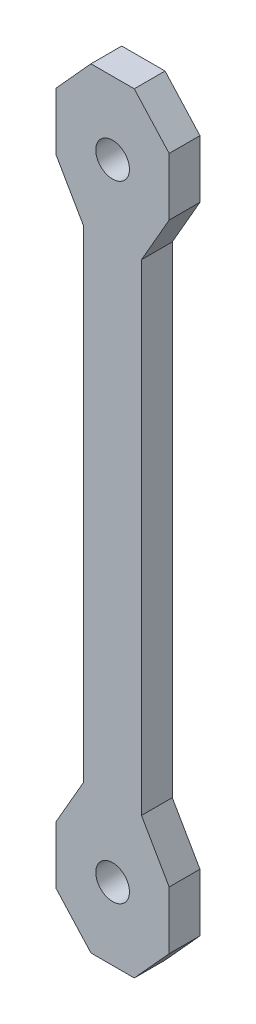
ISO-10303-21;
HEADER;
FILE_DESCRIPTION(('STEP AP214'),'2;1');
FILE_NAME('part.step','',(''),(''),'','','');
FILE_SCHEMA(('AUTOMOTIVE_DESIGN { 1 0 10303 214 1 1 1 1 }'));
ENDSEC;
DATA;
#1=APPLICATION_CONTEXT('core data for automotive mechanical design processes');
#2=APPLICATION_PROTOCOL_DEFINITION('international standard','automotive_design',2000,#1);
#3=PRODUCT_CONTEXT('',#1,'mechanical');
#4=PRODUCT('Part','Part','',(#3));
#5=PRODUCT_RELATED_PRODUCT_CATEGORY('part','',(#4));
#6=PRODUCT_DEFINITION_FORMATION('','',#4);
#7=PRODUCT_DEFINITION_CONTEXT('part definition',#1,'design');
#8=PRODUCT_DEFINITION('design','',#6,#7);
#9=PRODUCT_DEFINITION_SHAPE('','',#8);
#10=(LENGTH_UNIT() NAMED_UNIT(*) SI_UNIT(.MILLI.,.METRE.));
#11=(NAMED_UNIT(*) PLANE_ANGLE_UNIT() SI_UNIT($,.RADIAN.));
#12=(NAMED_UNIT(*) SI_UNIT($,.STERADIAN.) SOLID_ANGLE_UNIT());
#13=UNCERTAINTY_MEASURE_WITH_UNIT(LENGTH_MEASURE(1.E-05),#10,'distance_accuracy_value','');
#14=(GEOMETRIC_REPRESENTATION_CONTEXT(3) GLOBAL_UNCERTAINTY_ASSIGNED_CONTEXT((#13)) GLOBAL_UNIT_ASSIGNED_CONTEXT((#10,
#11,#12)) REPRESENTATION_CONTEXT('',''));
#15=CARTESIAN_POINT('',(0.,0.,0.));
#16=DIRECTION('',(0.,0.,1.));
#17=DIRECTION('',(1.,0.,0.));
#18=AXIS2_PLACEMENT_3D('',#15,#16,#17);
#19=CARTESIAN_POINT('',(0.,0.,6.4));
#20=DIRECTION('',(0.,0.,-1.));
#21=DIRECTION('',(-1.,0.,0.));
#22=AXIS2_PLACEMENT_3D('',#19,#20,#21);
#23=PLANE('',#22);
#24=DIRECTION('',(0.,-1.,0.));
#25=VECTOR('',#24,1.);
#26=CARTESIAN_POINT('',(-6.,15.1491889334921,6.4));
#27=LINE('',#26,#25);
#28=CARTESIAN_POINT('',(-6.,65.1491889334921,6.4));
#29=VERTEX_POINT('',#28);
#30=CARTESIAN_POINT('',(-6.,-34.8508110665079,6.4));
#31=VERTEX_POINT('',#30);
#32=EDGE_CURVE('E118',#29,#31,#27,.T.);
#33=ORIENTED_EDGE('',*,*,#32,.T.);
#34=DIRECTION('',(-0.498471124258083,-0.866906303057535,0.));
#35=VECTOR('',#34,1.);
#36=CARTESIAN_POINT('',(-6.,-34.8508110665079,6.4));
#37=LINE('',#36,#35);
#38=CARTESIAN_POINT('',(-11.75,-44.8508110665079,6.4));
#39=VERTEX_POINT('',#38);
#40=EDGE_CURVE('E300',#31,#39,#37,.T.);
#41=ORIENTED_EDGE('',*,*,#40,.T.);
#42=DIRECTION('',(0.,-1.,0.));
#43=VECTOR('',#42,1.);
#44=CARTESIAN_POINT('',(-11.75,-44.8508110665079,6.4));
#45=LINE('',#44,#43);
#46=CARTESIAN_POINT('',(-11.75,-56.8508110665079,6.4));
#47=VERTEX_POINT('',#46);
#48=EDGE_CURVE('E251',#39,#47,#45,.T.);
#49=ORIENTED_EDGE('',*,*,#48,.T.);
#50=DIRECTION('',(0.67151942473886,-0.740986951435983,0.));
#51=VECTOR('',#50,1.);
#52=CARTESIAN_POINT('',(-11.75,-56.8508110665079,6.4));
#53=LINE('',#52,#51);
#54=CARTESIAN_POINT('',(-4.49999999999998,-64.8508110665079,6.4));
#55=VERTEX_POINT('',#54);
#56=EDGE_CURVE('E270',#47,#55,#53,.T.);
#57=ORIENTED_EDGE('',*,*,#56,.T.);
#58=DIRECTION('',(1.,0.,0.));
#59=VECTOR('',#58,1.);
#60=CARTESIAN_POINT('',(-4.49999999999998,-64.8508110665079,6.4));
#61=LINE('',#60,#59);
#62=CARTESIAN_POINT('',(4.50000000000001,-64.8508110665079,6.4));
#63=VERTEX_POINT('',#62);
#64=EDGE_CURVE('E267',#55,#63,#61,.T.);
#65=ORIENTED_EDGE('',*,*,#64,.T.);
#66=DIRECTION('',(0.671519424738859,0.740986951435983,0.));
#67=VECTOR('',#66,1.);
#68=CARTESIAN_POINT('',(4.50000000000001,-64.8508110665079,6.4));
#69=LINE('',#68,#67);
#70=CARTESIAN_POINT('',(11.75,-56.8508110665079,6.4));
#71=VERTEX_POINT('',#70);
#72=EDGE_CURVE('E269',#63,#71,#69,.T.);
#73=ORIENTED_EDGE('',*,*,#72,.T.);
#74=DIRECTION('',(0.,1.,0.));
#75=VECTOR('',#74,1.);
#76=CARTESIAN_POINT('',(11.75,-56.8508110665079,6.4));
#77=LINE('',#76,#75);
#78=CARTESIAN_POINT('',(11.75,-44.8508110665079,6.4));
#79=VERTEX_POINT('',#78);
#80=EDGE_CURVE('E272',#71,#79,#77,.T.);
#81=ORIENTED_EDGE('',*,*,#80,.T.);
#82=DIRECTION('',(-0.498471124258083,0.866906303057535,0.));
#83=VECTOR('',#82,1.);
#84=CARTESIAN_POINT('',(11.75,-44.8508110665079,6.4));
#85=LINE('',#84,#83);
#86=CARTESIAN_POINT('',(6.,-34.8508110665079,6.4));
#87=VERTEX_POINT('',#86);
#88=EDGE_CURVE('E278',#79,#87,#85,.T.);
#89=ORIENTED_EDGE('',*,*,#88,.T.);
#90=DIRECTION('',(0.,1.,0.));
#91=VECTOR('',#90,1.);
#92=CARTESIAN_POINT('',(6.,15.1491889334921,6.4));
#93=LINE('',#92,#91);
#94=CARTESIAN_POINT('',(6.,65.1491889334921,6.4));
#95=VERTEX_POINT('',#94);
#96=EDGE_CURVE('E280',#87,#95,#93,.T.);
#97=ORIENTED_EDGE('',*,*,#96,.T.);
#98=DIRECTION('',(0.498471124258083,0.866906303057535,0.));
#99=VECTOR('',#98,1.);
#100=CARTESIAN_POINT('',(11.75,75.1491889334921,6.4));
#101=LINE('',#100,#99);
#102=CARTESIAN_POINT('',(11.75,75.1491889334921,6.4));
#103=VERTEX_POINT('',#102);
#104=EDGE_CURVE('E282',#95,#103,#101,.T.);
#105=ORIENTED_EDGE('',*,*,#104,.T.);
#106=DIRECTION('',(0.,1.,0.));
#107=VECTOR('',#106,1.);
#108=CARTESIAN_POINT('',(11.75,87.1491889334921,6.4));
#109=LINE('',#108,#107);
#110=CARTESIAN_POINT('',(11.75,87.1491889334921,6.4));
#111=VERTEX_POINT('',#110);
#112=EDGE_CURVE('E284',#103,#111,#109,.T.);
#113=ORIENTED_EDGE('',*,*,#112,.T.);
#114=DIRECTION('',(-0.67151942473886,0.740986951435982,0.));
#115=VECTOR('',#114,1.);
#116=CARTESIAN_POINT('',(4.50000000000001,95.1491889334921,6.4));
#117=LINE('',#116,#115);
#118=CARTESIAN_POINT('',(4.50000000000001,95.1491889334921,6.4));
#119=VERTEX_POINT('',#118);
#120=EDGE_CURVE('E286',#111,#119,#117,.T.);
#121=ORIENTED_EDGE('',*,*,#120,.T.);
#122=DIRECTION('',(-1.,0.,0.));
#123=VECTOR('',#122,1.);
#124=CARTESIAN_POINT('',(-4.49999999999998,95.1491889334921,6.4));
#125=LINE('',#124,#123);
#126=CARTESIAN_POINT('',(-4.49999999999998,95.1491889334921,6.4));
#127=VERTEX_POINT('',#126);
#128=EDGE_CURVE('E162',#119,#127,#125,.T.);
#129=ORIENTED_EDGE('',*,*,#128,.T.);
#130=DIRECTION('',(-0.67151942473886,-0.740986951435982,0.));
#131=VECTOR('',#130,1.);
#132=CARTESIAN_POINT('',(-11.75,87.1491889334921,6.4));
#133=LINE('',#132,#131);
#134=CARTESIAN_POINT('',(-11.75,87.1491889334921,6.4));
#135=VERTEX_POINT('',#134);
#136=EDGE_CURVE('E156',#127,#135,#133,.T.);
#137=ORIENTED_EDGE('',*,*,#136,.T.);
#138=DIRECTION('',(0.,-1.,0.));
#139=VECTOR('',#138,1.);
#140=CARTESIAN_POINT('',(-11.75,75.1491889334921,6.4));
#141=LINE('',#140,#139);
#142=CARTESIAN_POINT('',(-11.75,75.1491889334921,6.4));
#143=VERTEX_POINT('',#142);
#144=EDGE_CURVE('E160',#135,#143,#141,.T.);
#145=ORIENTED_EDGE('',*,*,#144,.T.);
#146=DIRECTION('',(0.498471124258083,-0.866906303057535,0.));
#147=VECTOR('',#146,1.);
#148=CARTESIAN_POINT('',(-6.,65.1491889334921,6.4));
#149=LINE('',#148,#147);
#150=EDGE_CURVE('E52',#143,#29,#149,.T.);
#151=ORIENTED_EDGE('',*,*,#150,.T.);
#152=EDGE_LOOP('',(#33,#41,#49,#57,#65,#73,#81,#89,#97,#105,#113,#121,#129,#137,#145,#151));
#153=FACE_BOUND('',#152,.T.);
#154=CARTESIAN_POINT('',(0.,-49.8508110665079,6.4));
#155=DIRECTION('',(0.,0.,1.));
#156=DIRECTION('',(1.,0.,0.));
#157=AXIS2_PLACEMENT_3D('',#154,#155,#156);
#158=CIRCLE('',#157,3.5);
#159=CARTESIAN_POINT('',(3.5,-49.8508110665079,6.4));
#160=VERTEX_POINT('',#159);
#161=EDGE_CURVE('E182',#160,#160,#158,.T.);
#162=ORIENTED_EDGE('',*,*,#161,.F.);
#163=EDGE_LOOP('',(#162));
#164=FACE_BOUND('',#163,.T.);
#165=CARTESIAN_POINT('',(0.,80.1491889334921,6.4));
#166=DIRECTION('',(0.,0.,1.));
#167=DIRECTION('',(-1.,0.,0.));
#168=AXIS2_PLACEMENT_3D('',#165,#166,#167);
#169=CIRCLE('',#168,3.5);
#170=CARTESIAN_POINT('',(-3.5,80.1491889334921,6.4));
#171=VERTEX_POINT('',#170);
#172=EDGE_CURVE('E491',#171,#171,#169,.T.);
#173=ORIENTED_EDGE('',*,*,#172,.F.);
#174=EDGE_LOOP('',(#173));
#175=FACE_BOUND('',#174,.T.);
#176=ADVANCED_FACE('F35',(#153,#164,#175),#23,.F.);
#177=CARTESIAN_POINT('',(0.,0.,0.));
#178=DIRECTION('',(0.,0.,-1.));
#179=DIRECTION('',(-1.,0.,0.));
#180=AXIS2_PLACEMENT_3D('',#177,#178,#179);
#181=PLANE('',#180);
#182=CARTESIAN_POINT('',(0.,-49.8508110665079,0.));
#183=DIRECTION('',(0.,0.,1.));
#184=DIRECTION('',(1.,0.,0.));
#185=AXIS2_PLACEMENT_3D('',#182,#183,#184);
#186=CIRCLE('',#185,3.5);
#187=CARTESIAN_POINT('',(3.5,-49.8508110665079,0.));
#188=VERTEX_POINT('',#187);
#189=EDGE_CURVE('E304',#188,#188,#186,.T.);
#190=ORIENTED_EDGE('',*,*,#189,.T.);
#191=EDGE_LOOP('',(#190));
#192=FACE_BOUND('',#191,.T.);
#193=DIRECTION('',(0.,-1.,0.));
#194=VECTOR('',#193,1.);
#195=CARTESIAN_POINT('',(-6.,15.1491889334921,0.));
#196=LINE('',#195,#194);
#197=CARTESIAN_POINT('',(-6.,65.1491889334921,0.));
#198=VERTEX_POINT('',#197);
#199=CARTESIAN_POINT('',(-6.,-34.8508110665079,0.));
#200=VERTEX_POINT('',#199);
#201=EDGE_CURVE('E112',#198,#200,#196,.T.);
#202=ORIENTED_EDGE('',*,*,#201,.F.);
#203=DIRECTION('',(0.498471124258083,-0.866906303057535,0.));
#204=VECTOR('',#203,1.);
#205=CARTESIAN_POINT('',(-6.,65.1491889334921,0.));
#206=LINE('',#205,#204);
#207=CARTESIAN_POINT('',(-11.75,75.1491889334921,0.));
#208=VERTEX_POINT('',#207);
#209=EDGE_CURVE('E209',#208,#198,#206,.T.);
#210=ORIENTED_EDGE('',*,*,#209,.F.);
#211=DIRECTION('',(0.,-1.,0.));
#212=VECTOR('',#211,1.);
#213=CARTESIAN_POINT('',(-11.75,75.1491889334921,0.));
#214=LINE('',#213,#212);
#215=CARTESIAN_POINT('',(-11.75,87.1491889334921,0.));
#216=VERTEX_POINT('',#215);
#217=EDGE_CURVE('E105',#216,#208,#214,.T.);
#218=ORIENTED_EDGE('',*,*,#217,.F.);
#219=DIRECTION('',(-0.67151942473886,-0.740986951435982,0.));
#220=VECTOR('',#219,1.);
#221=CARTESIAN_POINT('',(-11.75,87.1491889334921,0.));
#222=LINE('',#221,#220);
#223=CARTESIAN_POINT('',(-4.49999999999998,95.1491889334921,0.));
#224=VERTEX_POINT('',#223);
#225=EDGE_CURVE('E170',#224,#216,#222,.T.);
#226=ORIENTED_EDGE('',*,*,#225,.F.);
#227=DIRECTION('',(-1.,0.,0.));
#228=VECTOR('',#227,1.);
#229=CARTESIAN_POINT('',(-4.49999999999998,95.1491889334921,0.));
#230=LINE('',#229,#228);
#231=CARTESIAN_POINT('',(4.50000000000001,95.1491889334921,0.));
#232=VERTEX_POINT('',#231);
#233=EDGE_CURVE('E205',#232,#224,#230,.T.);
#234=ORIENTED_EDGE('',*,*,#233,.F.);
#235=DIRECTION('',(-0.67151942473886,0.740986951435982,0.));
#236=VECTOR('',#235,1.);
#237=CARTESIAN_POINT('',(4.50000000000001,95.1491889334921,0.));
#238=LINE('',#237,#236);
#239=CARTESIAN_POINT('',(11.75,87.1491889334921,0.));
#240=VERTEX_POINT('',#239);
#241=EDGE_CURVE('E203',#240,#232,#238,.T.);
#242=ORIENTED_EDGE('',*,*,#241,.F.);
#243=DIRECTION('',(0.,1.,0.));
#244=VECTOR('',#243,1.);
#245=CARTESIAN_POINT('',(11.75,87.1491889334921,0.));
#246=LINE('',#245,#244);
#247=CARTESIAN_POINT('',(11.75,75.1491889334921,0.));
#248=VERTEX_POINT('',#247);
#249=EDGE_CURVE('E201',#248,#240,#246,.T.);
#250=ORIENTED_EDGE('',*,*,#249,.F.);
#251=DIRECTION('',(0.498471124258083,0.866906303057535,0.));
#252=VECTOR('',#251,1.);
#253=CARTESIAN_POINT('',(11.75,75.1491889334921,0.));
#254=LINE('',#253,#252);
#255=CARTESIAN_POINT('',(6.,65.1491889334921,0.));
#256=VERTEX_POINT('',#255);
#257=EDGE_CURVE('E199',#256,#248,#254,.T.);
#258=ORIENTED_EDGE('',*,*,#257,.F.);
#259=DIRECTION('',(0.,1.,0.));
#260=VECTOR('',#259,1.);
#261=CARTESIAN_POINT('',(6.,65.1491889334921,0.));
#262=LINE('',#261,#260);
#263=CARTESIAN_POINT('',(6.,-34.8508110665079,0.));
#264=VERTEX_POINT('',#263);
#265=EDGE_CURVE('E197',#264,#256,#262,.T.);
#266=ORIENTED_EDGE('',*,*,#265,.F.);
#267=DIRECTION('',(-0.498471124258083,0.866906303057535,0.));
#268=VECTOR('',#267,1.);
#269=CARTESIAN_POINT('',(11.75,-44.8508110665079,0.));
#270=LINE('',#269,#268);
#271=CARTESIAN_POINT('',(11.75,-44.8508110665079,0.));
#272=VERTEX_POINT('',#271);
#273=EDGE_CURVE('E194',#272,#264,#270,.T.);
#274=ORIENTED_EDGE('',*,*,#273,.F.);
#275=DIRECTION('',(0.,1.,0.));
#276=VECTOR('',#275,1.);
#277=CARTESIAN_POINT('',(11.75,-56.8508110665079,0.));
#278=LINE('',#277,#276);
#279=CARTESIAN_POINT('',(11.75,-56.8508110665079,0.));
#280=VERTEX_POINT('',#279);
#281=EDGE_CURVE('E192',#280,#272,#278,.T.);
#282=ORIENTED_EDGE('',*,*,#281,.F.);
#283=DIRECTION('',(0.671519424738859,0.740986951435983,0.));
#284=VECTOR('',#283,1.);
#285=CARTESIAN_POINT('',(4.50000000000001,-64.8508110665079,0.));
#286=LINE('',#285,#284);
#287=CARTESIAN_POINT('',(4.50000000000001,-64.8508110665079,0.));
#288=VERTEX_POINT('',#287);
#289=EDGE_CURVE('E190',#288,#280,#286,.T.);
#290=ORIENTED_EDGE('',*,*,#289,.F.);
#291=DIRECTION('',(1.,0.,0.));
#292=VECTOR('',#291,1.);
#293=CARTESIAN_POINT('',(-4.49999999999998,-64.8508110665079,0.));
#294=LINE('',#293,#292);
#295=CARTESIAN_POINT('',(-4.49999999999998,-64.8508110665079,0.));
#296=VERTEX_POINT('',#295);
#297=EDGE_CURVE('E188',#296,#288,#294,.T.);
#298=ORIENTED_EDGE('',*,*,#297,.F.);
#299=DIRECTION('',(0.67151942473886,-0.740986951435983,0.));
#300=VECTOR('',#299,1.);
#301=CARTESIAN_POINT('',(-11.75,-56.8508110665079,0.));
#302=LINE('',#301,#300);
#303=CARTESIAN_POINT('',(-11.75,-56.8508110665079,0.));
#304=VERTEX_POINT('',#303);
#305=EDGE_CURVE('E186',#304,#296,#302,.T.);
#306=ORIENTED_EDGE('',*,*,#305,.F.);
#307=DIRECTION('',(0.,-1.,0.));
#308=VECTOR('',#307,1.);
#309=CARTESIAN_POINT('',(-11.75,-44.8508110665079,0.));
#310=LINE('',#309,#308);
#311=CARTESIAN_POINT('',(-11.75,-44.8508110665079,0.));
#312=VERTEX_POINT('',#311);
#313=EDGE_CURVE('E184',#312,#304,#310,.T.);
#314=ORIENTED_EDGE('',*,*,#313,.F.);
#315=DIRECTION('',(-0.498471124258083,-0.866906303057535,0.));
#316=VECTOR('',#315,1.);
#317=CARTESIAN_POINT('',(-6.,-34.8508110665079,0.));
#318=LINE('',#317,#316);
#319=EDGE_CURVE('E181',#200,#312,#318,.T.);
#320=ORIENTED_EDGE('',*,*,#319,.F.);
#321=EDGE_LOOP('',(#202,#210,#218,#226,#234,#242,#250,#258,#266,#274,#282,#290,#298,#306,#314,#320));
#322=FACE_BOUND('',#321,.T.);
#323=CARTESIAN_POINT('',(0.,80.1491889334921,0.));
#324=DIRECTION('',(0.,0.,1.));
#325=DIRECTION('',(-1.,0.,0.));
#326=AXIS2_PLACEMENT_3D('',#323,#324,#325);
#327=CIRCLE('',#326,3.5);
#328=CARTESIAN_POINT('',(-3.5,80.1491889334921,0.));
#329=VERTEX_POINT('',#328);
#330=EDGE_CURVE('E494',#329,#329,#327,.T.);
#331=ORIENTED_EDGE('',*,*,#330,.T.);
#332=EDGE_LOOP('',(#331));
#333=FACE_BOUND('',#332,.T.);
#334=ADVANCED_FACE('F255',(#192,#322,#333),#181,.T.);
#335=CARTESIAN_POINT('',(-6.,15.1491889334921,6.4));
#336=DIRECTION('',(1.,0.,0.));
#337=DIRECTION('',(0.,1.,0.));
#338=AXIS2_PLACEMENT_3D('',#335,#336,#337);
#339=PLANE('',#338);
#340=ORIENTED_EDGE('',*,*,#201,.T.);
#341=DIRECTION('',(0.,0.,-1.));
#342=VECTOR('',#341,1.);
#343=CARTESIAN_POINT('',(-6.,-34.8508110665079,6.4));
#344=LINE('',#343,#342);
#345=EDGE_CURVE('E11',#31,#200,#344,.T.);
#346=ORIENTED_EDGE('',*,*,#345,.F.);
#347=ORIENTED_EDGE('',*,*,#32,.F.);
#348=DIRECTION('',(0.,0.,-1.));
#349=VECTOR('',#348,1.);
#350=CARTESIAN_POINT('',(-6.,65.1491889334921,6.4));
#351=LINE('',#350,#349);
#352=EDGE_CURVE('E176',#29,#198,#351,.T.);
#353=ORIENTED_EDGE('',*,*,#352,.T.);
#354=EDGE_LOOP('',(#340,#346,#347,#353));
#355=FACE_BOUND('',#354,.T.);
#356=ADVANCED_FACE('F37',(#355),#339,.F.);
#357=CARTESIAN_POINT('',(-6.,-34.8508110665079,6.4));
#358=DIRECTION('',(0.866906303057535,-0.498471124258082,0.));
#359=DIRECTION('',(0.498471124258083,0.866906303057535,0.));
#360=AXIS2_PLACEMENT_3D('',#357,#358,#359);
#361=PLANE('',#360);
#362=ORIENTED_EDGE('',*,*,#319,.T.);
#363=DIRECTION('',(0.,0.,-1.));
#364=VECTOR('',#363,1.);
#365=CARTESIAN_POINT('',(-11.75,-44.8508110665079,6.4));
#366=LINE('',#365,#364);
#367=EDGE_CURVE('E44',#39,#312,#366,.T.);
#368=ORIENTED_EDGE('',*,*,#367,.F.);
#369=ORIENTED_EDGE('',*,*,#40,.F.);
#370=ORIENTED_EDGE('',*,*,#345,.T.);
#371=EDGE_LOOP('',(#362,#368,#369,#370));
#372=FACE_BOUND('',#371,.T.);
#373=ADVANCED_FACE('F306',(#372),#361,.F.);
#374=CARTESIAN_POINT('',(-11.75,-44.8508110665079,6.4));
#375=DIRECTION('',(1.,0.,0.));
#376=DIRECTION('',(0.,1.,0.));
#377=AXIS2_PLACEMENT_3D('',#374,#375,#376);
#378=PLANE('',#377);
#379=ORIENTED_EDGE('',*,*,#313,.T.);
#380=DIRECTION('',(0.,0.,-1.));
#381=VECTOR('',#380,1.);
#382=CARTESIAN_POINT('',(-11.75,-56.8508110665079,6.4));
#383=LINE('',#382,#381);
#384=EDGE_CURVE('E242',#47,#304,#383,.T.);
#385=ORIENTED_EDGE('',*,*,#384,.F.);
#386=ORIENTED_EDGE('',*,*,#48,.F.);
#387=ORIENTED_EDGE('',*,*,#367,.T.);
#388=EDGE_LOOP('',(#379,#385,#386,#387));
#389=FACE_BOUND('',#388,.T.);
#390=ADVANCED_FACE('F249',(#389),#378,.F.);
#391=CARTESIAN_POINT('',(-11.75,-56.8508110665079,6.4));
#392=DIRECTION('',(0.740986951435983,0.671519424738859,0.));
#393=DIRECTION('',(-0.671519424738859,0.740986951435983,0.));
#394=AXIS2_PLACEMENT_3D('',#391,#392,#393);
#395=PLANE('',#394);
#396=ORIENTED_EDGE('',*,*,#305,.T.);
#397=DIRECTION('',(0.,0.,-1.));
#398=VECTOR('',#397,1.);
#399=CARTESIAN_POINT('',(-4.49999999999998,-64.8508110665079,6.4));
#400=LINE('',#399,#398);
#401=EDGE_CURVE('E239',#55,#296,#400,.T.);
#402=ORIENTED_EDGE('',*,*,#401,.F.);
#403=ORIENTED_EDGE('',*,*,#56,.F.);
#404=ORIENTED_EDGE('',*,*,#384,.T.);
#405=EDGE_LOOP('',(#396,#402,#403,#404));
#406=FACE_BOUND('',#405,.T.);
#407=ADVANCED_FACE('F261',(#406),#395,.F.);
#408=CARTESIAN_POINT('',(-4.49999999999998,-64.8508110665079,6.4));
#409=DIRECTION('',(0.,1.,0.));
#410=DIRECTION('',(0.,0.,1.));
#411=AXIS2_PLACEMENT_3D('',#408,#409,#410);
#412=PLANE('',#411);
#413=ORIENTED_EDGE('',*,*,#297,.T.);
#414=DIRECTION('',(0.,0.,-1.));
#415=VECTOR('',#414,1.);
#416=CARTESIAN_POINT('',(4.50000000000001,-64.8508110665079,6.4));
#417=LINE('',#416,#415);
#418=EDGE_CURVE('E236',#63,#288,#417,.T.);
#419=ORIENTED_EDGE('',*,*,#418,.F.);
#420=ORIENTED_EDGE('',*,*,#64,.F.);
#421=ORIENTED_EDGE('',*,*,#401,.T.);
#422=EDGE_LOOP('',(#413,#419,#420,#421));
#423=FACE_BOUND('',#422,.T.);
#424=ADVANCED_FACE('F265',(#423),#412,.F.);
#425=CARTESIAN_POINT('',(4.50000000000001,-64.8508110665079,6.4));
#426=DIRECTION('',(-0.740986951435983,0.671519424738859,0.));
#427=DIRECTION('',(-0.671519424738859,-0.740986951435983,0.));
#428=AXIS2_PLACEMENT_3D('',#425,#426,#427);
#429=PLANE('',#428);
#430=ORIENTED_EDGE('',*,*,#289,.T.);
#431=DIRECTION('',(0.,0.,-1.));
#432=VECTOR('',#431,1.);
#433=CARTESIAN_POINT('',(11.75,-56.8508110665079,6.4));
#434=LINE('',#433,#432);
#435=EDGE_CURVE('E233',#71,#280,#434,.T.);
#436=ORIENTED_EDGE('',*,*,#435,.F.);
#437=ORIENTED_EDGE('',*,*,#72,.F.);
#438=ORIENTED_EDGE('',*,*,#418,.T.);
#439=EDGE_LOOP('',(#430,#436,#437,#438));
#440=FACE_BOUND('',#439,.T.);
#441=ADVANCED_FACE('F353',(#440),#429,.F.);
#442=CARTESIAN_POINT('',(11.75,-56.8508110665079,6.4));
#443=DIRECTION('',(-1.,0.,0.));
#444=DIRECTION('',(0.,0.,1.));
#445=AXIS2_PLACEMENT_3D('',#442,#443,#444);
#446=PLANE('',#445);
#447=ORIENTED_EDGE('',*,*,#281,.T.);
#448=DIRECTION('',(0.,0.,-1.));
#449=VECTOR('',#448,1.);
#450=CARTESIAN_POINT('',(11.75,-44.8508110665079,6.4));
#451=LINE('',#450,#449);
#452=EDGE_CURVE('E230',#79,#272,#451,.T.);
#453=ORIENTED_EDGE('',*,*,#452,.F.);
#454=ORIENTED_EDGE('',*,*,#80,.F.);
#455=ORIENTED_EDGE('',*,*,#435,.T.);
#456=EDGE_LOOP('',(#447,#453,#454,#455));
#457=FACE_BOUND('',#456,.T.);
#458=ADVANCED_FACE('F349',(#457),#446,.F.);
#459=CARTESIAN_POINT('',(11.75,-44.8508110665079,6.4));
#460=DIRECTION('',(-0.866906303057535,-0.498471124258083,0.));
#461=DIRECTION('',(0.498471124258083,-0.866906303057535,0.));
#462=AXIS2_PLACEMENT_3D('',#459,#460,#461);
#463=PLANE('',#462);
#464=ORIENTED_EDGE('',*,*,#273,.T.);
#465=DIRECTION('',(0.,0.,-1.));
#466=VECTOR('',#465,1.);
#467=CARTESIAN_POINT('',(6.,-34.8508110665079,6.4));
#468=LINE('',#467,#466);
#469=EDGE_CURVE('E227',#87,#264,#468,.T.);
#470=ORIENTED_EDGE('',*,*,#469,.F.);
#471=ORIENTED_EDGE('',*,*,#88,.F.);
#472=ORIENTED_EDGE('',*,*,#452,.T.);
#473=EDGE_LOOP('',(#464,#470,#471,#472));
#474=FACE_BOUND('',#473,.T.);
#475=ADVANCED_FACE('F345',(#474),#463,.F.);
#476=CARTESIAN_POINT('',(6.,65.1491889334921,6.4));
#477=DIRECTION('',(-1.,0.,0.));
#478=DIRECTION('',(0.,-1.,0.));
#479=AXIS2_PLACEMENT_3D('',#476,#477,#478);
#480=PLANE('',#479);
#481=ORIENTED_EDGE('',*,*,#265,.T.);
#482=DIRECTION('',(0.,0.,-1.));
#483=VECTOR('',#482,1.);
#484=CARTESIAN_POINT('',(6.,65.1491889334921,6.4));
#485=LINE('',#484,#483);
#486=EDGE_CURVE('E224',#95,#256,#485,.T.);
#487=ORIENTED_EDGE('',*,*,#486,.F.);
#488=ORIENTED_EDGE('',*,*,#96,.F.);
#489=ORIENTED_EDGE('',*,*,#469,.T.);
#490=EDGE_LOOP('',(#481,#487,#488,#489));
#491=FACE_BOUND('',#490,.T.);
#492=ADVANCED_FACE('F341',(#491),#480,.F.);
#493=CARTESIAN_POINT('',(11.75,75.1491889334921,6.4));
#494=DIRECTION('',(-0.866906303057535,0.498471124258083,0.));
#495=DIRECTION('',(-0.498471124258083,-0.866906303057535,0.));
#496=AXIS2_PLACEMENT_3D('',#493,#494,#495);
#497=PLANE('',#496);
#498=ORIENTED_EDGE('',*,*,#257,.T.);
#499=DIRECTION('',(0.,0.,-1.));
#500=VECTOR('',#499,1.);
#501=CARTESIAN_POINT('',(11.75,75.1491889334921,6.4));
#502=LINE('',#501,#500);
#503=EDGE_CURVE('E221',#103,#248,#502,.T.);
#504=ORIENTED_EDGE('',*,*,#503,.F.);
#505=ORIENTED_EDGE('',*,*,#104,.F.);
#506=ORIENTED_EDGE('',*,*,#486,.T.);
#507=EDGE_LOOP('',(#498,#504,#505,#506));
#508=FACE_BOUND('',#507,.T.);
#509=ADVANCED_FACE('F337',(#508),#497,.F.);
#510=CARTESIAN_POINT('',(11.75,87.1491889334921,6.4));
#511=DIRECTION('',(-1.,0.,0.));
#512=DIRECTION('',(0.,0.,1.));
#513=AXIS2_PLACEMENT_3D('',#510,#511,#512);
#514=PLANE('',#513);
#515=ORIENTED_EDGE('',*,*,#249,.T.);
#516=DIRECTION('',(0.,0.,-1.));
#517=VECTOR('',#516,1.);
#518=CARTESIAN_POINT('',(11.75,87.1491889334921,6.4));
#519=LINE('',#518,#517);
#520=EDGE_CURVE('E218',#111,#240,#519,.T.);
#521=ORIENTED_EDGE('',*,*,#520,.F.);
#522=ORIENTED_EDGE('',*,*,#112,.F.);
#523=ORIENTED_EDGE('',*,*,#503,.T.);
#524=EDGE_LOOP('',(#515,#521,#522,#523));
#525=FACE_BOUND('',#524,.T.);
#526=ADVANCED_FACE('F334',(#525),#514,.F.);
#527=CARTESIAN_POINT('',(4.50000000000001,95.1491889334921,6.4));
#528=DIRECTION('',(-0.740986951435982,-0.67151942473886,0.));
#529=DIRECTION('',(0.67151942473886,-0.740986951435982,0.));
#530=AXIS2_PLACEMENT_3D('',#527,#528,#529);
#531=PLANE('',#530);
#532=ORIENTED_EDGE('',*,*,#241,.T.);
#533=DIRECTION('',(0.,0.,-1.));
#534=VECTOR('',#533,1.);
#535=CARTESIAN_POINT('',(4.50000000000001,95.1491889334921,6.4));
#536=LINE('',#535,#534);
#537=EDGE_CURVE('E215',#119,#232,#536,.T.);
#538=ORIENTED_EDGE('',*,*,#537,.F.);
#539=ORIENTED_EDGE('',*,*,#120,.F.);
#540=ORIENTED_EDGE('',*,*,#520,.T.);
#541=EDGE_LOOP('',(#532,#538,#539,#540));
#542=FACE_BOUND('',#541,.T.);
#543=ADVANCED_FACE('F292',(#542),#531,.F.);
#544=CARTESIAN_POINT('',(-4.49999999999998,95.1491889334921,6.4));
#545=DIRECTION('',(0.,-1.,0.));
#546=DIRECTION('',(0.,0.,-1.));
#547=AXIS2_PLACEMENT_3D('',#544,#545,#546);
#548=PLANE('',#547);
#549=ORIENTED_EDGE('',*,*,#233,.T.);
#550=DIRECTION('',(0.,0.,-1.));
#551=VECTOR('',#550,1.);
#552=CARTESIAN_POINT('',(-4.49999999999998,95.1491889334921,6.4));
#553=LINE('',#552,#551);
#554=EDGE_CURVE('E171',#127,#224,#553,.T.);
#555=ORIENTED_EDGE('',*,*,#554,.F.);
#556=ORIENTED_EDGE('',*,*,#128,.F.);
#557=ORIENTED_EDGE('',*,*,#537,.T.);
#558=EDGE_LOOP('',(#549,#555,#556,#557));
#559=FACE_BOUND('',#558,.T.);
#560=ADVANCED_FACE('F296',(#559),#548,.F.);
#561=CARTESIAN_POINT('',(-11.75,87.1491889334921,6.4));
#562=DIRECTION('',(0.740986951435982,-0.67151942473886,0.));
#563=DIRECTION('',(0.671519424738861,0.740986951435982,0.));
#564=AXIS2_PLACEMENT_3D('',#561,#562,#563);
#565=PLANE('',#564);
#566=ORIENTED_EDGE('',*,*,#225,.T.);
#567=DIRECTION('',(0.,0.,-1.));
#568=VECTOR('',#567,1.);
#569=CARTESIAN_POINT('',(-11.75,87.1491889334921,6.4));
#570=LINE('',#569,#568);
#571=EDGE_CURVE('E167',#135,#216,#570,.T.);
#572=ORIENTED_EDGE('',*,*,#571,.F.);
#573=ORIENTED_EDGE('',*,*,#136,.F.);
#574=ORIENTED_EDGE('',*,*,#554,.T.);
#575=EDGE_LOOP('',(#566,#572,#573,#574));
#576=FACE_BOUND('',#575,.T.);
#577=ADVANCED_FACE('F168',(#576),#565,.F.);
#578=CARTESIAN_POINT('',(-11.75,75.1491889334921,6.4));
#579=DIRECTION('',(1.,0.,0.));
#580=DIRECTION('',(0.,1.,0.));
#581=AXIS2_PLACEMENT_3D('',#578,#579,#580);
#582=PLANE('',#581);
#583=ORIENTED_EDGE('',*,*,#217,.T.);
#584=DIRECTION('',(0.,0.,-1.));
#585=VECTOR('',#584,1.);
#586=CARTESIAN_POINT('',(-11.75,75.1491889334921,6.4));
#587=LINE('',#586,#585);
#588=EDGE_CURVE('E172',#143,#208,#587,.T.);
#589=ORIENTED_EDGE('',*,*,#588,.F.);
#590=ORIENTED_EDGE('',*,*,#144,.F.);
#591=ORIENTED_EDGE('',*,*,#571,.T.);
#592=EDGE_LOOP('',(#583,#589,#590,#591));
#593=FACE_BOUND('',#592,.T.);
#594=ADVANCED_FACE('F174',(#593),#582,.F.);
#595=CARTESIAN_POINT('',(-6.,65.1491889334921,6.4));
#596=DIRECTION('',(0.866906303057535,0.498471124258082,0.));
#597=DIRECTION('',(-0.498471124258083,0.866906303057535,0.));
#598=AXIS2_PLACEMENT_3D('',#595,#596,#597);
#599=PLANE('',#598);
#600=ORIENTED_EDGE('',*,*,#209,.T.);
#601=ORIENTED_EDGE('',*,*,#352,.F.);
#602=ORIENTED_EDGE('',*,*,#150,.F.);
#603=ORIENTED_EDGE('',*,*,#588,.T.);
#604=EDGE_LOOP('',(#600,#601,#602,#603));
#605=FACE_BOUND('',#604,.T.);
#606=ADVANCED_FACE('F298',(#605),#599,.F.);
#607=CARTESIAN_POINT('',(0.,-49.8508110665079,6.4));
#608=DIRECTION('',(0.,0.,-1.));
#609=DIRECTION('',(-1.,0.,0.));
#610=AXIS2_PLACEMENT_3D('',#607,#608,#609);
#611=CYLINDRICAL_SURFACE('',#610,3.5);
#612=ORIENTED_EDGE('',*,*,#161,.T.);
#613=EDGE_LOOP('',(#612));
#614=FACE_BOUND('',#613,.T.);
#615=ORIENTED_EDGE('',*,*,#189,.F.);
#616=EDGE_LOOP('',(#615));
#617=FACE_BOUND('',#616,.T.);
#618=ADVANCED_FACE('F321',(#614,#617),#611,.F.);
#619=CARTESIAN_POINT('',(0.,80.1491889334921,6.4));
#620=DIRECTION('',(0.,0.,-1.));
#621=DIRECTION('',(-1.,0.,0.));
#622=AXIS2_PLACEMENT_3D('',#619,#620,#621);
#623=CYLINDRICAL_SURFACE('',#622,3.5);
#624=ORIENTED_EDGE('',*,*,#172,.T.);
#625=EDGE_LOOP('',(#624));
#626=FACE_BOUND('',#625,.T.);
#627=ORIENTED_EDGE('',*,*,#330,.F.);
#628=EDGE_LOOP('',(#627));
#629=FACE_BOUND('',#628,.T.);
#630=ADVANCED_FACE('F419',(#626,#629),#623,.F.);
#631=CLOSED_SHELL('',(#176,#334,#356,#373,#390,#407,#424,#441,#458,#475,#492,#509,#526,#543,
#560,#577,#594,#606,#618,#630));
#632=MANIFOLD_SOLID_BREP('B2',#631);
#633=ADVANCED_BREP_SHAPE_REPRESENTATION('',(#18,#632),#14);
#634=SHAPE_DEFINITION_REPRESENTATION(#9,#633);
ENDSEC;
END-ISO-10303-21;
